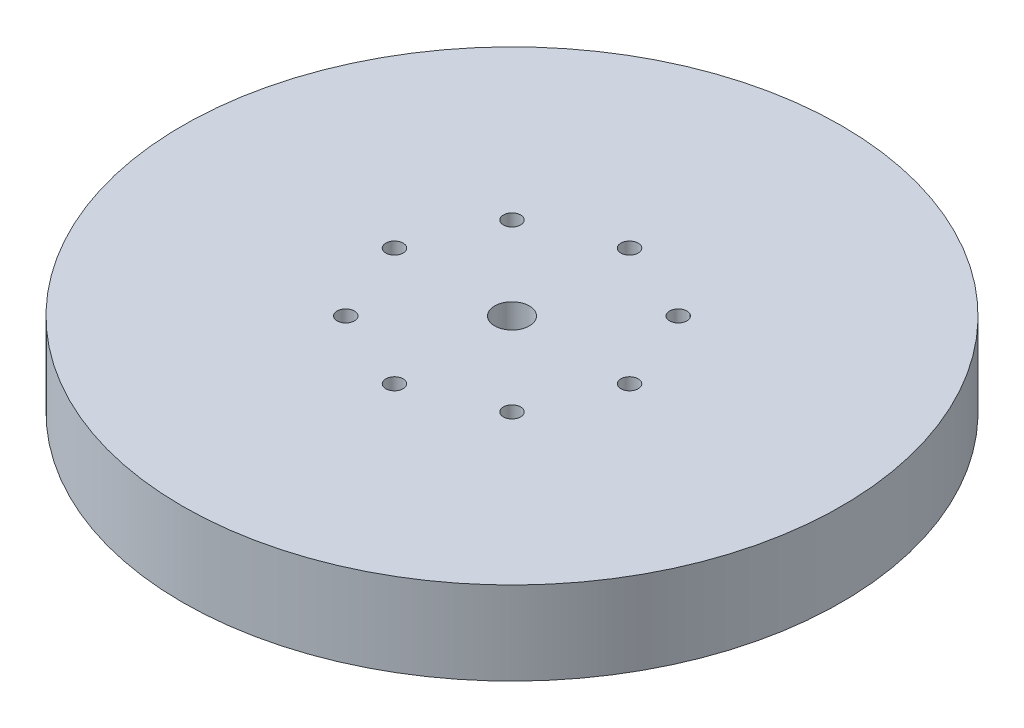
ISO-10303-21;
HEADER;
FILE_DESCRIPTION(('STEP AP214'),'2;1');
FILE_NAME('part.step','',(''),(''),'','','');
FILE_SCHEMA(('AUTOMOTIVE_DESIGN { 1 0 10303 214 1 1 1 1 }'));
ENDSEC;
DATA;
#1=APPLICATION_CONTEXT('core data for automotive mechanical design processes');
#2=APPLICATION_PROTOCOL_DEFINITION('international standard','automotive_design',2000,#1);
#3=PRODUCT_CONTEXT('',#1,'mechanical');
#4=PRODUCT('Part','Part','',(#3));
#5=PRODUCT_RELATED_PRODUCT_CATEGORY('part','',(#4));
#6=PRODUCT_DEFINITION_FORMATION('','',#4);
#7=PRODUCT_DEFINITION_CONTEXT('part definition',#1,'design');
#8=PRODUCT_DEFINITION('design','',#6,#7);
#9=PRODUCT_DEFINITION_SHAPE('','',#8);
#10=(LENGTH_UNIT() NAMED_UNIT(*) SI_UNIT(.MILLI.,.METRE.));
#11=(NAMED_UNIT(*) PLANE_ANGLE_UNIT() SI_UNIT($,.RADIAN.));
#12=(NAMED_UNIT(*) SI_UNIT($,.STERADIAN.) SOLID_ANGLE_UNIT());
#13=UNCERTAINTY_MEASURE_WITH_UNIT(LENGTH_MEASURE(1.E-05),#10,'distance_accuracy_value','');
#14=(GEOMETRIC_REPRESENTATION_CONTEXT(3) GLOBAL_UNCERTAINTY_ASSIGNED_CONTEXT((#13)) GLOBAL_UNIT_ASSIGNED_CONTEXT((#10,
#11,#12)) REPRESENTATION_CONTEXT('',''));
#15=CARTESIAN_POINT('',(0.,0.,0.));
#16=DIRECTION('',(0.,0.,1.));
#17=DIRECTION('',(1.,0.,0.));
#18=AXIS2_PLACEMENT_3D('',#15,#16,#17);
#19=CARTESIAN_POINT('',(0.,24.,0.));
#20=DIRECTION('',(0.,-1.,0.));
#21=DIRECTION('',(0.,0.,-1.));
#22=AXIS2_PLACEMENT_3D('',#19,#20,#21);
#23=CYLINDRICAL_SURFACE('',#22,95.);
#24=CARTESIAN_POINT('',(0.,24.,0.));
#25=DIRECTION('',(0.,1.,0.));
#26=DIRECTION('',(0.,0.,1.));
#27=AXIS2_PLACEMENT_3D('',#24,#25,#26);
#28=CIRCLE('',#27,95.);
#29=CARTESIAN_POINT('',(0.,24.,95.));
#30=VERTEX_POINT('',#29);
#31=EDGE_CURVE('E10',#30,#30,#28,.T.);
#32=ORIENTED_EDGE('',*,*,#31,.F.);
#33=EDGE_LOOP('',(#32));
#34=FACE_BOUND('',#33,.T.);
#35=CARTESIAN_POINT('',(0.,0.,0.));
#36=DIRECTION('',(0.,1.,0.));
#37=DIRECTION('',(0.,0.,1.));
#38=AXIS2_PLACEMENT_3D('',#35,#36,#37);
#39=CIRCLE('',#38,95.);
#40=CARTESIAN_POINT('',(0.,0.,95.));
#41=VERTEX_POINT('',#40);
#42=EDGE_CURVE('E37',#41,#41,#39,.T.);
#43=ORIENTED_EDGE('',*,*,#42,.T.);
#44=EDGE_LOOP('',(#43));
#45=FACE_BOUND('',#44,.T.);
#46=ADVANCED_FACE('F40',(#34,#45),#23,.T.);
#47=CARTESIAN_POINT('',(0.,24.,0.));
#48=DIRECTION('',(0.,1.,0.));
#49=DIRECTION('',(0.,0.,1.));
#50=AXIS2_PLACEMENT_3D('',#47,#48,#49);
#51=PLANE('',#50);
#52=CARTESIAN_POINT('',(1.18297690189271E-13,24.,33.8818050874842));
#53=DIRECTION('',(0.,1.,0.));
#54=DIRECTION('',(1.,0.,0.));
#55=AXIS2_PLACEMENT_3D('',#52,#53,#54);
#56=CIRCLE('',#55,2.49665127292669);
#57=CARTESIAN_POINT('',(2.49665127292681,24.,33.8818050874842));
#58=VERTEX_POINT('',#57);
#59=EDGE_CURVE('E88',#58,#58,#56,.T.);
#60=ORIENTED_EDGE('',*,*,#59,.F.);
#61=EDGE_LOOP('',(#60));
#62=FACE_BOUND('',#61,.T.);
#63=CARTESIAN_POINT('',(23.958054136201,24.,23.9580541362008));
#64=DIRECTION('',(0.,1.,0.));
#65=DIRECTION('',(0.707106781186544,0.,-0.707106781186551));
#66=AXIS2_PLACEMENT_3D('',#63,#64,#65);
#67=CIRCLE('',#66,2.49665127292669);
#68=CARTESIAN_POINT('',(25.7234531815455,24.,22.1926550908563));
#69=VERTEX_POINT('',#68);
#70=EDGE_CURVE('E79',#69,#69,#67,.T.);
#71=ORIENTED_EDGE('',*,*,#70,.F.);
#72=EDGE_LOOP('',(#71));
#73=FACE_BOUND('',#72,.T.);
#74=CARTESIAN_POINT('',(33.8818050874842,24.,0.));
#75=DIRECTION('',(0.,1.,0.));
#76=DIRECTION('',(0.,0.,-1.));
#77=AXIS2_PLACEMENT_3D('',#74,#75,#76);
#78=CIRCLE('',#77,2.49665127292669);
#79=CARTESIAN_POINT('',(33.8818050874842,24.,-2.49665127292669));
#80=VERTEX_POINT('',#79);
#81=EDGE_CURVE('E74',#80,#80,#78,.T.);
#82=ORIENTED_EDGE('',*,*,#81,.F.);
#83=EDGE_LOOP('',(#82));
#84=FACE_BOUND('',#83,.T.);
#85=CARTESIAN_POINT('',(23.9580541362007,24.,-23.9580541362011));
#86=DIRECTION('',(0.,1.,0.));
#87=DIRECTION('',(-0.707106781186554,0.,-0.707106781186541));
#88=AXIS2_PLACEMENT_3D('',#85,#86,#87);
#89=CIRCLE('',#88,2.49665127292669);
#90=CARTESIAN_POINT('',(22.1926550908562,24.,-25.7234531815456));
#91=VERTEX_POINT('',#90);
#92=EDGE_CURVE('E70',#91,#91,#89,.T.);
#93=ORIENTED_EDGE('',*,*,#92,.F.);
#94=EDGE_LOOP('',(#93));
#95=FACE_BOUND('',#94,.T.);
#96=CARTESIAN_POINT('',(-3.54893070567814E-13,24.,-33.8818050874842));
#97=DIRECTION('',(0.,1.,0.));
#98=DIRECTION('',(-1.,0.,0.));
#99=AXIS2_PLACEMENT_3D('',#96,#97,#98);
#100=CIRCLE('',#99,2.49665127292669);
#101=CARTESIAN_POINT('',(-2.49665127292704,24.,-33.8818050874841));
#102=VERTEX_POINT('',#101);
#103=EDGE_CURVE('E100',#102,#102,#100,.T.);
#104=ORIENTED_EDGE('',*,*,#103,.F.);
#105=EDGE_LOOP('',(#104));
#106=FACE_BOUND('',#105,.T.);
#107=CARTESIAN_POINT('',(-23.9580541362012,24.,-23.9580541362006));
#108=DIRECTION('',(0.,1.,0.));
#109=DIRECTION('',(-0.707106781186539,0.,0.707106781186556));
#110=AXIS2_PLACEMENT_3D('',#107,#108,#109);
#111=CIRCLE('',#110,2.49665127292669);
#112=CARTESIAN_POINT('',(-25.7234531815457,24.,-22.1926550908561));
#113=VERTEX_POINT('',#112);
#114=EDGE_CURVE('E93',#113,#113,#111,.T.);
#115=ORIENTED_EDGE('',*,*,#114,.F.);
#116=EDGE_LOOP('',(#115));
#117=FACE_BOUND('',#116,.T.);
#118=CARTESIAN_POINT('',(-23.9580541362009,24.,23.958054136201));
#119=DIRECTION('',(0.,1.,0.));
#120=DIRECTION('',(0.707106781186549,0.,0.707106781186546));
#121=AXIS2_PLACEMENT_3D('',#118,#119,#120);
#122=CIRCLE('',#121,2.49665127292669);
#123=CARTESIAN_POINT('',(-22.1926550908564,24.,25.7234531815454));
#124=VERTEX_POINT('',#123);
#125=EDGE_CURVE('E61',#124,#124,#122,.T.);
#126=ORIENTED_EDGE('',*,*,#125,.F.);
#127=EDGE_LOOP('',(#126));
#128=FACE_BOUND('',#127,.T.);
#129=CARTESIAN_POINT('',(-33.8818050874842,24.,0.));
#130=DIRECTION('',(0.,1.,0.));
#131=DIRECTION('',(0.,0.,1.));
#132=AXIS2_PLACEMENT_3D('',#129,#130,#131);
#133=CIRCLE('',#132,2.49665127292669);
#134=CARTESIAN_POINT('',(-33.8818050874842,24.,2.49665127292669));
#135=VERTEX_POINT('',#134);
#136=EDGE_CURVE('E54',#135,#135,#133,.T.);
#137=ORIENTED_EDGE('',*,*,#136,.F.);
#138=EDGE_LOOP('',(#137));
#139=FACE_BOUND('',#138,.T.);
#140=CARTESIAN_POINT('',(0.,24.,0.));
#141=DIRECTION('',(0.,1.,0.));
#142=DIRECTION('',(0.,0.,1.));
#143=AXIS2_PLACEMENT_3D('',#140,#141,#142);
#144=CIRCLE('',#143,5.);
#145=CARTESIAN_POINT('',(0.,24.,5.));
#146=VERTEX_POINT('',#145);
#147=EDGE_CURVE('E50',#146,#146,#144,.T.);
#148=ORIENTED_EDGE('',*,*,#147,.F.);
#149=EDGE_LOOP('',(#148));
#150=FACE_BOUND('',#149,.T.);
#151=ORIENTED_EDGE('',*,*,#31,.T.);
#152=EDGE_LOOP('',(#151));
#153=FACE_BOUND('',#152,.T.);
#154=ADVANCED_FACE('F115',(#62,#73,#84,#95,#106,#117,#128,#139,#150,#153),#51,.T.);
#155=CARTESIAN_POINT('',(0.,0.,0.));
#156=DIRECTION('',(0.,1.,0.));
#157=DIRECTION('',(0.,0.,1.));
#158=AXIS2_PLACEMENT_3D('',#155,#156,#157);
#159=PLANE('',#158);
#160=CARTESIAN_POINT('',(0.,0.,0.));
#161=DIRECTION('',(0.,1.,0.));
#162=DIRECTION('',(0.,0.,1.));
#163=AXIS2_PLACEMENT_3D('',#160,#161,#162);
#164=CIRCLE('',#163,5.);
#165=CARTESIAN_POINT('',(0.,0.,5.));
#166=VERTEX_POINT('',#165);
#167=EDGE_CURVE('E47',#166,#166,#164,.T.);
#168=ORIENTED_EDGE('',*,*,#167,.T.);
#169=EDGE_LOOP('',(#168));
#170=FACE_BOUND('',#169,.T.);
#171=ORIENTED_EDGE('',*,*,#42,.F.);
#172=EDGE_LOOP('',(#171));
#173=FACE_BOUND('',#172,.T.);
#174=ADVANCED_FACE('F113',(#170,#173),#159,.F.);
#175=CARTESIAN_POINT('',(0.,24.,0.));
#176=DIRECTION('',(0.,-1.,0.));
#177=DIRECTION('',(0.,0.,-1.));
#178=AXIS2_PLACEMENT_3D('',#175,#176,#177);
#179=CYLINDRICAL_SURFACE('',#178,5.);
#180=ORIENTED_EDGE('',*,*,#147,.T.);
#181=EDGE_LOOP('',(#180));
#182=FACE_BOUND('',#181,.T.);
#183=ORIENTED_EDGE('',*,*,#167,.F.);
#184=EDGE_LOOP('',(#183));
#185=FACE_BOUND('',#184,.T.);
#186=ADVANCED_FACE('F127',(#182,#185),#179,.F.);
#187=CARTESIAN_POINT('',(-33.8818050874842,2.86671708350154,0.));
#188=DIRECTION('',(0.,1.,0.));
#189=DIRECTION('',(0.,0.,1.));
#190=AXIS2_PLACEMENT_3D('',#187,#188,#189);
#191=CYLINDRICAL_SURFACE('',#190,2.49665127292669);
#192=CARTESIAN_POINT('',(-33.8818050874842,2.86671708350154,0.));
#193=DIRECTION('',(0.,1.,0.));
#194=DIRECTION('',(0.,0.,1.));
#195=AXIS2_PLACEMENT_3D('',#192,#193,#194);
#196=CIRCLE('',#195,2.49665127292669);
#197=CARTESIAN_POINT('',(-33.8818050874842,2.86671708350154,2.49665127292669));
#198=VERTEX_POINT('',#197);
#199=EDGE_CURVE('E55',#198,#198,#196,.T.);
#200=ORIENTED_EDGE('',*,*,#199,.F.);
#201=EDGE_LOOP('',(#200));
#202=FACE_BOUND('',#201,.T.);
#203=ORIENTED_EDGE('',*,*,#136,.T.);
#204=EDGE_LOOP('',(#203));
#205=FACE_BOUND('',#204,.T.);
#206=ADVANCED_FACE('F129',(#202,#205),#191,.F.);
#207=CARTESIAN_POINT('',(-33.8818050874842,2.86671708350154,0.));
#208=DIRECTION('',(0.,1.,0.));
#209=DIRECTION('',(0.,0.,1.));
#210=AXIS2_PLACEMENT_3D('',#207,#208,#209);
#211=PLANE('',#210);
#212=ORIENTED_EDGE('',*,*,#199,.T.);
#213=EDGE_LOOP('',(#212));
#214=FACE_BOUND('',#213,.T.);
#215=ADVANCED_FACE('F157',(#214),#211,.T.);
#216=CARTESIAN_POINT('',(-23.9580541362009,2.86671708350154,23.958054136201));
#217=DIRECTION('',(0.,1.,0.));
#218=DIRECTION('',(0.,0.,1.));
#219=AXIS2_PLACEMENT_3D('',#216,#217,#218);
#220=CYLINDRICAL_SURFACE('',#219,2.49665127292669);
#221=CARTESIAN_POINT('',(-23.9580541362009,2.86671708350154,23.958054136201));
#222=DIRECTION('',(0.,1.,0.));
#223=DIRECTION('',(0.707106781186549,0.,0.707106781186546));
#224=AXIS2_PLACEMENT_3D('',#221,#222,#223);
#225=CIRCLE('',#224,2.49665127292669);
#226=CARTESIAN_POINT('',(-22.1926550908564,2.86671708350154,25.7234531815454));
#227=VERTEX_POINT('',#226);
#228=EDGE_CURVE('E59',#227,#227,#225,.T.);
#229=ORIENTED_EDGE('',*,*,#228,.F.);
#230=EDGE_LOOP('',(#229));
#231=FACE_BOUND('',#230,.T.);
#232=ORIENTED_EDGE('',*,*,#125,.T.);
#233=EDGE_LOOP('',(#232));
#234=FACE_BOUND('',#233,.T.);
#235=ADVANCED_FACE('F170',(#231,#234),#220,.F.);
#236=CARTESIAN_POINT('',(-23.9580541362009,2.86671708350154,23.958054136201));
#237=DIRECTION('',(0.,1.,0.));
#238=DIRECTION('',(0.707106781186549,0.,0.707106781186546));
#239=AXIS2_PLACEMENT_3D('',#236,#237,#238);
#240=PLANE('',#239);
#241=ORIENTED_EDGE('',*,*,#228,.T.);
#242=EDGE_LOOP('',(#241));
#243=FACE_BOUND('',#242,.T.);
#244=ADVANCED_FACE('F182',(#243),#240,.T.);
#245=CARTESIAN_POINT('',(-23.9580541362012,2.86671708350154,-23.9580541362006));
#246=DIRECTION('',(0.,1.,0.));
#247=DIRECTION('',(0.,0.,1.));
#248=AXIS2_PLACEMENT_3D('',#245,#246,#247);
#249=CYLINDRICAL_SURFACE('',#248,2.49665127292669);
#250=CARTESIAN_POINT('',(-23.9580541362012,2.86671708350154,-23.9580541362006));
#251=DIRECTION('',(0.,1.,0.));
#252=DIRECTION('',(-0.707106781186539,0.,0.707106781186556));
#253=AXIS2_PLACEMENT_3D('',#250,#251,#252);
#254=CIRCLE('',#253,2.49665127292669);
#255=CARTESIAN_POINT('',(-25.7234531815457,2.86671708350154,-22.1926550908561));
#256=VERTEX_POINT('',#255);
#257=EDGE_CURVE('E94',#256,#256,#254,.T.);
#258=ORIENTED_EDGE('',*,*,#257,.F.);
#259=EDGE_LOOP('',(#258));
#260=FACE_BOUND('',#259,.T.);
#261=ORIENTED_EDGE('',*,*,#114,.T.);
#262=EDGE_LOOP('',(#261));
#263=FACE_BOUND('',#262,.T.);
#264=ADVANCED_FACE('F189',(#260,#263),#249,.F.);
#265=CARTESIAN_POINT('',(-23.9580541362012,2.86671708350154,-23.9580541362006));
#266=DIRECTION('',(0.,1.,0.));
#267=DIRECTION('',(-0.707106781186539,0.,0.707106781186556));
#268=AXIS2_PLACEMENT_3D('',#265,#266,#267);
#269=PLANE('',#268);
#270=ORIENTED_EDGE('',*,*,#257,.T.);
#271=EDGE_LOOP('',(#270));
#272=FACE_BOUND('',#271,.T.);
#273=ADVANCED_FACE('F107',(#272),#269,.T.);
#274=CARTESIAN_POINT('',(-3.54893070567814E-13,2.86671708350154,-33.8818050874842));
#275=DIRECTION('',(0.,1.,0.));
#276=DIRECTION('',(0.,0.,1.));
#277=AXIS2_PLACEMENT_3D('',#274,#275,#276);
#278=CYLINDRICAL_SURFACE('',#277,2.49665127292669);
#279=CARTESIAN_POINT('',(-3.54893070567814E-13,2.86671708350154,-33.8818050874842));
#280=DIRECTION('',(0.,1.,0.));
#281=DIRECTION('',(-1.,0.,0.));
#282=AXIS2_PLACEMENT_3D('',#279,#280,#281);
#283=CIRCLE('',#282,2.49665127292669);
#284=CARTESIAN_POINT('',(-2.49665127292704,2.86671708350154,-33.8818050874841));
#285=VERTEX_POINT('',#284);
#286=EDGE_CURVE('E72',#285,#285,#283,.T.);
#287=ORIENTED_EDGE('',*,*,#286,.F.);
#288=EDGE_LOOP('',(#287));
#289=FACE_BOUND('',#288,.T.);
#290=ORIENTED_EDGE('',*,*,#103,.T.);
#291=EDGE_LOOP('',(#290));
#292=FACE_BOUND('',#291,.T.);
#293=ADVANCED_FACE('F104',(#289,#292),#278,.F.);
#294=CARTESIAN_POINT('',(-3.54893070567814E-13,2.86671708350154,-33.8818050874842));
#295=DIRECTION('',(0.,1.,0.));
#296=DIRECTION('',(-1.,0.,0.));
#297=AXIS2_PLACEMENT_3D('',#294,#295,#296);
#298=PLANE('',#297);
#299=ORIENTED_EDGE('',*,*,#286,.T.);
#300=EDGE_LOOP('',(#299));
#301=FACE_BOUND('',#300,.T.);
#302=ADVANCED_FACE('F103',(#301),#298,.T.);
#303=CARTESIAN_POINT('',(23.9580541362007,2.86671708350154,-23.9580541362011));
#304=DIRECTION('',(0.,1.,0.));
#305=DIRECTION('',(0.,0.,1.));
#306=AXIS2_PLACEMENT_3D('',#303,#304,#305);
#307=CYLINDRICAL_SURFACE('',#306,2.49665127292669);
#308=CARTESIAN_POINT('',(23.9580541362007,2.86671708350154,-23.9580541362011));
#309=DIRECTION('',(0.,1.,0.));
#310=DIRECTION('',(-0.707106781186554,0.,-0.707106781186541));
#311=AXIS2_PLACEMENT_3D('',#308,#309,#310);
#312=CIRCLE('',#311,2.49665127292669);
#313=CARTESIAN_POINT('',(22.1926550908562,2.86671708350154,-25.7234531815456));
#314=VERTEX_POINT('',#313);
#315=EDGE_CURVE('E69',#314,#314,#312,.T.);
#316=ORIENTED_EDGE('',*,*,#315,.F.);
#317=EDGE_LOOP('',(#316));
#318=FACE_BOUND('',#317,.T.);
#319=ORIENTED_EDGE('',*,*,#92,.T.);
#320=EDGE_LOOP('',(#319));
#321=FACE_BOUND('',#320,.T.);
#322=ADVANCED_FACE('F219',(#318,#321),#307,.F.);
#323=CARTESIAN_POINT('',(23.9580541362007,2.86671708350154,-23.9580541362011));
#324=DIRECTION('',(0.,1.,0.));
#325=DIRECTION('',(-0.707106781186554,0.,-0.707106781186541));
#326=AXIS2_PLACEMENT_3D('',#323,#324,#325);
#327=PLANE('',#326);
#328=ORIENTED_EDGE('',*,*,#315,.T.);
#329=EDGE_LOOP('',(#328));
#330=FACE_BOUND('',#329,.T.);
#331=ADVANCED_FACE('F227',(#330),#327,.T.);
#332=CARTESIAN_POINT('',(33.8818050874842,2.86671708350154,0.));
#333=DIRECTION('',(0.,1.,0.));
#334=DIRECTION('',(0.,0.,1.));
#335=AXIS2_PLACEMENT_3D('',#332,#333,#334);
#336=CYLINDRICAL_SURFACE('',#335,2.49665127292669);
#337=CARTESIAN_POINT('',(33.8818050874842,2.86671708350154,0.));
#338=DIRECTION('',(0.,1.,0.));
#339=DIRECTION('',(0.,0.,-1.));
#340=AXIS2_PLACEMENT_3D('',#337,#338,#339);
#341=CIRCLE('',#340,2.49665127292669);
#342=CARTESIAN_POINT('',(33.8818050874842,2.86671708350154,-2.49665127292669));
#343=VERTEX_POINT('',#342);
#344=EDGE_CURVE('E80',#343,#343,#341,.T.);
#345=ORIENTED_EDGE('',*,*,#344,.F.);
#346=EDGE_LOOP('',(#345));
#347=FACE_BOUND('',#346,.T.);
#348=ORIENTED_EDGE('',*,*,#81,.T.);
#349=EDGE_LOOP('',(#348));
#350=FACE_BOUND('',#349,.T.);
#351=ADVANCED_FACE('F240',(#347,#350),#336,.F.);
#352=CARTESIAN_POINT('',(33.8818050874842,2.86671708350154,0.));
#353=DIRECTION('',(0.,1.,0.));
#354=DIRECTION('',(0.,0.,-1.));
#355=AXIS2_PLACEMENT_3D('',#352,#353,#354);
#356=PLANE('',#355);
#357=ORIENTED_EDGE('',*,*,#344,.T.);
#358=EDGE_LOOP('',(#357));
#359=FACE_BOUND('',#358,.T.);
#360=ADVANCED_FACE('F246',(#359),#356,.T.);
#361=CARTESIAN_POINT('',(23.958054136201,2.86671708350154,23.9580541362008));
#362=DIRECTION('',(0.,1.,0.));
#363=DIRECTION('',(0.,0.,1.));
#364=AXIS2_PLACEMENT_3D('',#361,#362,#363);
#365=CYLINDRICAL_SURFACE('',#364,2.49665127292669);
#366=CARTESIAN_POINT('',(23.958054136201,2.86671708350154,23.9580541362008));
#367=DIRECTION('',(0.,1.,0.));
#368=DIRECTION('',(0.707106781186544,0.,-0.707106781186551));
#369=AXIS2_PLACEMENT_3D('',#366,#367,#368);
#370=CIRCLE('',#369,2.49665127292669);
#371=CARTESIAN_POINT('',(25.7234531815455,2.86671708350154,22.1926550908563));
#372=VERTEX_POINT('',#371);
#373=EDGE_CURVE('E82',#372,#372,#370,.T.);
#374=ORIENTED_EDGE('',*,*,#373,.F.);
#375=EDGE_LOOP('',(#374));
#376=FACE_BOUND('',#375,.T.);
#377=ORIENTED_EDGE('',*,*,#70,.T.);
#378=EDGE_LOOP('',(#377));
#379=FACE_BOUND('',#378,.T.);
#380=ADVANCED_FACE('F254',(#376,#379),#365,.F.);
#381=CARTESIAN_POINT('',(23.958054136201,2.86671708350154,23.9580541362008));
#382=DIRECTION('',(0.,1.,0.));
#383=DIRECTION('',(0.707106781186544,0.,-0.707106781186551));
#384=AXIS2_PLACEMENT_3D('',#381,#382,#383);
#385=PLANE('',#384);
#386=ORIENTED_EDGE('',*,*,#373,.T.);
#387=EDGE_LOOP('',(#386));
#388=FACE_BOUND('',#387,.T.);
#389=ADVANCED_FACE('F262',(#388),#385,.T.);
#390=CARTESIAN_POINT('',(1.18297690189271E-13,2.86671708350154,33.8818050874842));
#391=DIRECTION('',(0.,1.,0.));
#392=DIRECTION('',(0.,0.,1.));
#393=AXIS2_PLACEMENT_3D('',#390,#391,#392);
#394=CYLINDRICAL_SURFACE('',#393,2.49665127292669);
#395=CARTESIAN_POINT('',(1.18297690189271E-13,2.86671708350154,33.8818050874842));
#396=DIRECTION('',(0.,1.,0.));
#397=DIRECTION('',(1.,0.,0.));
#398=AXIS2_PLACEMENT_3D('',#395,#396,#397);
#399=CIRCLE('',#398,2.49665127292669);
#400=CARTESIAN_POINT('',(2.49665127292681,2.86671708350154,33.8818050874842));
#401=VERTEX_POINT('',#400);
#402=EDGE_CURVE('E63',#401,#401,#399,.T.);
#403=ORIENTED_EDGE('',*,*,#402,.F.);
#404=EDGE_LOOP('',(#403));
#405=FACE_BOUND('',#404,.T.);
#406=ORIENTED_EDGE('',*,*,#59,.T.);
#407=EDGE_LOOP('',(#406));
#408=FACE_BOUND('',#407,.T.);
#409=ADVANCED_FACE('F272',(#405,#408),#394,.F.);
#410=CARTESIAN_POINT('',(1.18297690189271E-13,2.86671708350154,33.8818050874842));
#411=DIRECTION('',(0.,1.,0.));
#412=DIRECTION('',(1.,0.,0.));
#413=AXIS2_PLACEMENT_3D('',#410,#411,#412);
#414=PLANE('',#413);
#415=ORIENTED_EDGE('',*,*,#402,.T.);
#416=EDGE_LOOP('',(#415));
#417=FACE_BOUND('',#416,.T.);
#418=ADVANCED_FACE('F285',(#417),#414,.T.);
#419=CLOSED_SHELL('',(#46,#154,#174,#186,#206,#215,#235,#244,#264,#273,#293,#302,#322,#331,#351,
#360,#380,#389,#409,#418));
#420=MANIFOLD_SOLID_BREP('B2',#419);
#421=ADVANCED_BREP_SHAPE_REPRESENTATION('',(#18,#420),#14);
#422=SHAPE_DEFINITION_REPRESENTATION(#9,#421);
ENDSEC;
END-ISO-10303-21;
